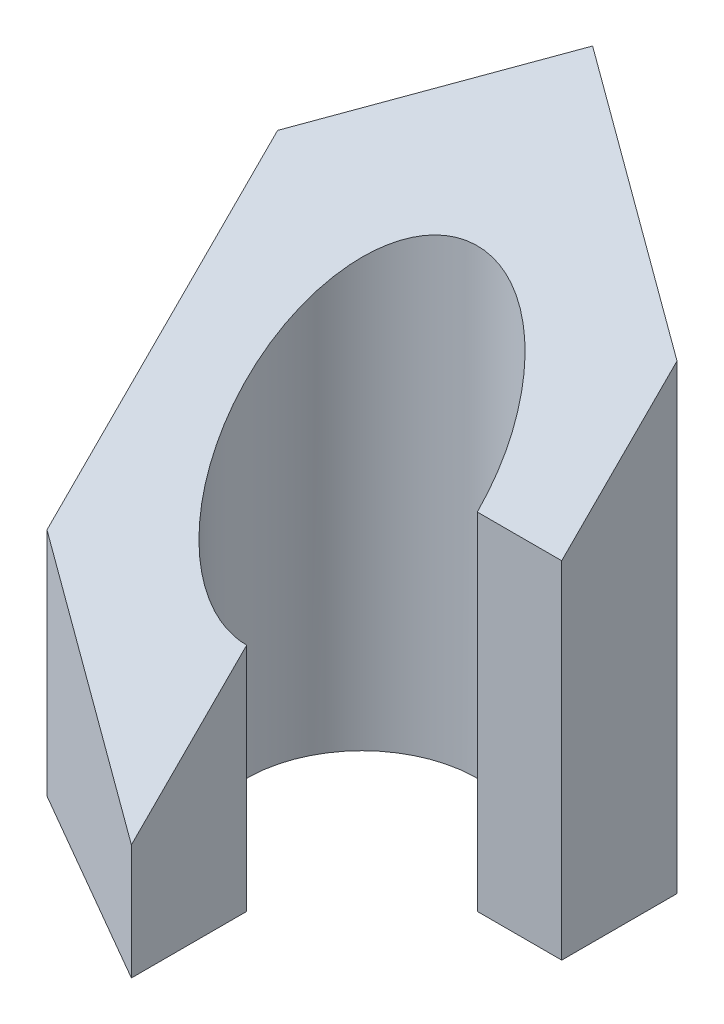
ISO-10303-21;
HEADER;
FILE_DESCRIPTION(('STEP AP214'),'2;1');
FILE_NAME('part.step','',(''),(''),'','','');
FILE_SCHEMA(('AUTOMOTIVE_DESIGN { 1 0 10303 214 1 1 1 1 }'));
ENDSEC;
DATA;
#1=APPLICATION_CONTEXT('core data for automotive mechanical design processes');
#2=APPLICATION_PROTOCOL_DEFINITION('international standard','automotive_design',2000,#1);
#3=PRODUCT_CONTEXT('',#1,'mechanical');
#4=PRODUCT('Part','Part','',(#3));
#5=PRODUCT_RELATED_PRODUCT_CATEGORY('part','',(#4));
#6=PRODUCT_DEFINITION_FORMATION('','',#4);
#7=PRODUCT_DEFINITION_CONTEXT('part definition',#1,'design');
#8=PRODUCT_DEFINITION('design','',#6,#7);
#9=PRODUCT_DEFINITION_SHAPE('','',#8);
#10=(LENGTH_UNIT() NAMED_UNIT(*) SI_UNIT(.MILLI.,.METRE.));
#11=(NAMED_UNIT(*) PLANE_ANGLE_UNIT() SI_UNIT($,.RADIAN.));
#12=(NAMED_UNIT(*) SI_UNIT($,.STERADIAN.) SOLID_ANGLE_UNIT());
#13=UNCERTAINTY_MEASURE_WITH_UNIT(LENGTH_MEASURE(1.E-05),#10,'distance_accuracy_value','');
#14=(GEOMETRIC_REPRESENTATION_CONTEXT(3) GLOBAL_UNCERTAINTY_ASSIGNED_CONTEXT((#13)) GLOBAL_UNIT_ASSIGNED_CONTEXT((#10,
#11,#12)) REPRESENTATION_CONTEXT('',''));
#15=CARTESIAN_POINT('',(0.,0.,0.));
#16=DIRECTION('',(0.,0.,1.));
#17=DIRECTION('',(1.,0.,0.));
#18=AXIS2_PLACEMENT_3D('',#15,#16,#17);
#19=CARTESIAN_POINT('',(3.46410161513776,10.,0.));
#20=DIRECTION('',(-1.,0.,0.));
#21=DIRECTION('',(0.,0.,1.));
#22=AXIS2_PLACEMENT_3D('',#19,#20,#21);
#23=PLANE('',#22);
#24=DIRECTION('',(0.,0.707106781186547,-0.707106781186548));
#25=VECTOR('',#24,1.);
#26=CARTESIAN_POINT('',(3.46410161513776,7.99999999999998,-2.00000000000001));
#27=LINE('',#26,#25);
#28=CARTESIAN_POINT('',(3.46410161513776,5.99999999999997,0.));
#29=VERTEX_POINT('',#28);
#30=CARTESIAN_POINT('',(3.46410161513776,7.99999999999998,-2.));
#31=VERTEX_POINT('',#30);
#32=EDGE_CURVE('E169',#29,#31,#27,.T.);
#33=ORIENTED_EDGE('',*,*,#32,.F.);
#34=DIRECTION('',(0.,-1.,0.));
#35=VECTOR('',#34,1.);
#36=CARTESIAN_POINT('',(3.46410161513776,10.,0.));
#37=LINE('',#36,#35);
#38=CARTESIAN_POINT('',(3.46410161513776,0.,0.));
#39=VERTEX_POINT('',#38);
#40=EDGE_CURVE('E55',#29,#39,#37,.T.);
#41=ORIENTED_EDGE('',*,*,#40,.T.);
#42=DIRECTION('',(0.,0.,-1.));
#43=VECTOR('',#42,1.);
#44=CARTESIAN_POINT('',(3.46410161513776,0.,0.));
#45=LINE('',#44,#43);
#46=CARTESIAN_POINT('',(3.46410161513776,0.,-2.00000000000001));
#47=VERTEX_POINT('',#46);
#48=EDGE_CURVE('E148',#39,#47,#45,.T.);
#49=ORIENTED_EDGE('',*,*,#48,.T.);
#50=DIRECTION('',(0.,-1.,0.));
#51=VECTOR('',#50,1.);
#52=CARTESIAN_POINT('',(3.46410161513776,10.,-2.00000000000001));
#53=LINE('',#52,#51);
#54=EDGE_CURVE('E11',#31,#47,#53,.T.);
#55=ORIENTED_EDGE('',*,*,#54,.F.);
#56=EDGE_LOOP('',(#33,#41,#49,#55));
#57=FACE_BOUND('',#56,.T.);
#58=ADVANCED_FACE('F33',(#57),#23,.F.);
#59=CARTESIAN_POINT('',(3.46410161513776,10.,-2.00000000000001));
#60=DIRECTION('',(-0.499999999999999,0.,0.866025403784439));
#61=DIRECTION('',(0.866025403784439,0.,0.499999999999999));
#62=AXIS2_PLACEMENT_3D('',#59,#60,#61);
#63=PLANE('',#62);
#64=DIRECTION('',(-0.774596669241483,0.447213595499961,-0.447213595499956));
#65=VECTOR('',#64,1.);
#66=CARTESIAN_POINT('',(2.77128129211019,8.39999999999999,-2.40000000000001));
#67=LINE('',#66,#65);
#68=CARTESIAN_POINT('',(0.,10.,-4.));
#69=VERTEX_POINT('',#68);
#70=EDGE_CURVE('E170',#31,#69,#67,.T.);
#71=ORIENTED_EDGE('',*,*,#70,.F.);
#72=ORIENTED_EDGE('',*,*,#54,.T.);
#73=DIRECTION('',(-0.866025403784439,0.,-0.499999999999999));
#74=VECTOR('',#73,1.);
#75=CARTESIAN_POINT('',(3.46410161513776,0.,-2.00000000000001));
#76=LINE('',#75,#74);
#77=CARTESIAN_POINT('',(0.,0.,-4.));
#78=VERTEX_POINT('',#77);
#79=EDGE_CURVE('E143',#47,#78,#76,.T.);
#80=ORIENTED_EDGE('',*,*,#79,.T.);
#81=DIRECTION('',(0.,-1.,0.));
#82=VECTOR('',#81,1.);
#83=CARTESIAN_POINT('',(0.,10.,-4.));
#84=LINE('',#83,#82);
#85=EDGE_CURVE('E40',#69,#78,#84,.T.);
#86=ORIENTED_EDGE('',*,*,#85,.F.);
#87=EDGE_LOOP('',(#71,#72,#80,#86));
#88=FACE_BOUND('',#87,.T.);
#89=ADVANCED_FACE('F177',(#88),#63,.F.);
#90=CARTESIAN_POINT('',(0.,10.,-4.));
#91=DIRECTION('',(0.500000000000001,0.,0.866025403784438));
#92=DIRECTION('',(0.866025403784438,0.,-0.500000000000001));
#93=AXIS2_PLACEMENT_3D('',#90,#91,#92);
#94=PLANE('',#93);
#95=DIRECTION('',(-0.774596669241484,-0.447213595499954,0.44721359549996));
#96=VECTOR('',#95,1.);
#97=CARTESIAN_POINT('',(0.,10.,-4.));
#98=LINE('',#97,#96);
#99=CARTESIAN_POINT('',(-3.46410161513775,8.00000000000002,-2.));
#100=VERTEX_POINT('',#99);
#101=EDGE_CURVE('E136',#69,#100,#98,.T.);
#102=ORIENTED_EDGE('',*,*,#101,.F.);
#103=ORIENTED_EDGE('',*,*,#85,.T.);
#104=DIRECTION('',(-0.866025403784438,0.,0.500000000000001));
#105=VECTOR('',#104,1.);
#106=CARTESIAN_POINT('',(0.,0.,-4.));
#107=LINE('',#106,#105);
#108=CARTESIAN_POINT('',(-3.46410161513775,0.,-2.));
#109=VERTEX_POINT('',#108);
#110=EDGE_CURVE('E134',#78,#109,#107,.T.);
#111=ORIENTED_EDGE('',*,*,#110,.T.);
#112=DIRECTION('',(0.,-1.,0.));
#113=VECTOR('',#112,1.);
#114=CARTESIAN_POINT('',(-3.46410161513775,10.,-2.));
#115=LINE('',#114,#113);
#116=EDGE_CURVE('E120',#100,#109,#115,.T.);
#117=ORIENTED_EDGE('',*,*,#116,.F.);
#118=EDGE_LOOP('',(#102,#103,#111,#117));
#119=FACE_BOUND('',#118,.T.);
#120=ADVANCED_FACE('F132',(#119),#94,.F.);
#121=CARTESIAN_POINT('',(-3.46410161513775,10.,-2.));
#122=DIRECTION('',(1.,0.,0.));
#123=DIRECTION('',(0.,0.,-1.));
#124=AXIS2_PLACEMENT_3D('',#121,#122,#123);
#125=PLANE('',#124);
#126=DIRECTION('',(0.,-0.707106781186547,0.707106781186548));
#127=VECTOR('',#126,1.);
#128=CARTESIAN_POINT('',(-3.46410161513775,9.00000000000001,-2.99999999999999));
#129=LINE('',#128,#127);
#130=CARTESIAN_POINT('',(-3.46410161513775,4.00000000000003,2.));
#131=VERTEX_POINT('',#130);
#132=EDGE_CURVE('E101',#100,#131,#129,.T.);
#133=ORIENTED_EDGE('',*,*,#132,.F.);
#134=ORIENTED_EDGE('',*,*,#116,.T.);
#135=DIRECTION('',(0.,0.,1.));
#136=VECTOR('',#135,1.);
#137=CARTESIAN_POINT('',(-3.46410161513775,0.,-2.));
#138=LINE('',#137,#136);
#139=CARTESIAN_POINT('',(-3.46410161513775,0.,2.));
#140=VERTEX_POINT('',#139);
#141=EDGE_CURVE('E145',#109,#140,#138,.T.);
#142=ORIENTED_EDGE('',*,*,#141,.T.);
#143=DIRECTION('',(0.,-1.,0.));
#144=VECTOR('',#143,1.);
#145=CARTESIAN_POINT('',(-3.46410161513775,10.,2.));
#146=LINE('',#145,#144);
#147=EDGE_CURVE('E118',#131,#140,#146,.T.);
#148=ORIENTED_EDGE('',*,*,#147,.F.);
#149=EDGE_LOOP('',(#133,#134,#142,#148));
#150=FACE_BOUND('',#149,.T.);
#151=ADVANCED_FACE('F179',(#150),#125,.F.);
#152=CARTESIAN_POINT('',(-3.46410161513775,10.,2.));
#153=DIRECTION('',(0.5,0.,-0.866025403784439));
#154=DIRECTION('',(-0.866025403784439,0.,-0.5));
#155=AXIS2_PLACEMENT_3D('',#152,#153,#154);
#156=PLANE('',#155);
#157=DIRECTION('',(0.774596669241482,-0.447213595499962,0.447213595499957));
#158=VECTOR('',#157,1.);
#159=CARTESIAN_POINT('',(-5.54256258422041,5.20000000000004,0.799999999999997));
#160=LINE('',#159,#158);
#161=CARTESIAN_POINT('',(0.,2.,4.));
#162=VERTEX_POINT('',#161);
#163=EDGE_CURVE('E96',#131,#162,#160,.T.);
#164=ORIENTED_EDGE('',*,*,#163,.F.);
#165=ORIENTED_EDGE('',*,*,#147,.T.);
#166=DIRECTION('',(0.866025403784439,0.,0.5));
#167=VECTOR('',#166,1.);
#168=CARTESIAN_POINT('',(-3.46410161513775,0.,2.));
#169=LINE('',#168,#167);
#170=CARTESIAN_POINT('',(0.,0.,4.));
#171=VERTEX_POINT('',#170);
#172=EDGE_CURVE('E116',#140,#171,#169,.T.);
#173=ORIENTED_EDGE('',*,*,#172,.T.);
#174=DIRECTION('',(0.,-1.,0.));
#175=VECTOR('',#174,1.);
#176=CARTESIAN_POINT('',(0.,10.,4.));
#177=LINE('',#176,#175);
#178=EDGE_CURVE('E110',#162,#171,#177,.T.);
#179=ORIENTED_EDGE('',*,*,#178,.F.);
#180=EDGE_LOOP('',(#164,#165,#173,#179));
#181=FACE_BOUND('',#180,.T.);
#182=ADVANCED_FACE('F114',(#181),#156,.F.);
#183=CARTESIAN_POINT('',(0.,10.,2.));
#184=DIRECTION('',(-1.,0.,0.));
#185=DIRECTION('',(0.,0.,1.));
#186=AXIS2_PLACEMENT_3D('',#183,#184,#185);
#187=PLANE('',#186);
#188=DIRECTION('',(0.,0.707106781186547,-0.707106781186548));
#189=VECTOR('',#188,1.);
#190=CARTESIAN_POINT('',(0.,7.,-0.999999999999999));
#191=LINE('',#190,#189);
#192=CARTESIAN_POINT('',(0.,4.,2.));
#193=VERTEX_POINT('',#192);
#194=EDGE_CURVE('E99',#162,#193,#191,.T.);
#195=ORIENTED_EDGE('',*,*,#194,.F.);
#196=ORIENTED_EDGE('',*,*,#178,.T.);
#197=DIRECTION('',(0.,0.,-1.));
#198=VECTOR('',#197,1.);
#199=CARTESIAN_POINT('',(0.,0.,2.));
#200=LINE('',#199,#198);
#201=CARTESIAN_POINT('',(0.,0.,2.));
#202=VERTEX_POINT('',#201);
#203=EDGE_CURVE('E153',#171,#202,#200,.T.);
#204=ORIENTED_EDGE('',*,*,#203,.T.);
#205=DIRECTION('',(0.,-1.,0.));
#206=VECTOR('',#205,1.);
#207=CARTESIAN_POINT('',(0.,10.,2.));
#208=LINE('',#207,#206);
#209=EDGE_CURVE('E112',#193,#202,#208,.T.);
#210=ORIENTED_EDGE('',*,*,#209,.F.);
#211=EDGE_LOOP('',(#195,#196,#204,#210));
#212=FACE_BOUND('',#211,.T.);
#213=ADVANCED_FACE('F108',(#212),#187,.F.);
#214=CARTESIAN_POINT('',(0.,10.,0.));
#215=DIRECTION('',(0.,-1.,0.));
#216=DIRECTION('',(0.,0.,-1.));
#217=AXIS2_PLACEMENT_3D('',#214,#215,#216);
#218=CYLINDRICAL_SURFACE('',#217,2.);
#219=CARTESIAN_POINT('',(0.,6.,0.));
#220=DIRECTION('',(0.,0.707106781186548,0.707106781186547));
#221=DIRECTION('',(0.,-0.707106781186547,0.707106781186548));
#222=AXIS2_PLACEMENT_3D('',#219,#220,#221);
#223=ELLIPSE('',#222,2.82842712474619,2.);
#224=CARTESIAN_POINT('',(2.,5.99999999999998,0.));
#225=VERTEX_POINT('',#224);
#226=EDGE_CURVE('E47',#193,#225,#223,.F.);
#227=ORIENTED_EDGE('',*,*,#226,.F.);
#228=ORIENTED_EDGE('',*,*,#209,.T.);
#229=CARTESIAN_POINT('',(0.,0.,0.));
#230=DIRECTION('',(0.,-1.,0.));
#231=DIRECTION('',(0.,0.,1.));
#232=AXIS2_PLACEMENT_3D('',#229,#230,#231);
#233=CIRCLE('',#232,2.);
#234=CARTESIAN_POINT('',(2.,0.,0.));
#235=VERTEX_POINT('',#234);
#236=EDGE_CURVE('E155',#202,#235,#233,.T.);
#237=ORIENTED_EDGE('',*,*,#236,.T.);
#238=DIRECTION('',(0.,-1.,0.));
#239=VECTOR('',#238,1.);
#240=CARTESIAN_POINT('',(2.,10.,0.));
#241=LINE('',#240,#239);
#242=EDGE_CURVE('E122',#225,#235,#241,.T.);
#243=ORIENTED_EDGE('',*,*,#242,.F.);
#244=EDGE_LOOP('',(#227,#228,#237,#243));
#245=FACE_BOUND('',#244,.T.);
#246=ADVANCED_FACE('F167',(#245),#218,.F.);
#247=CARTESIAN_POINT('',(2.,10.,0.));
#248=DIRECTION('',(0.,0.,-1.));
#249=DIRECTION('',(-1.,0.,0.));
#250=AXIS2_PLACEMENT_3D('',#247,#248,#249);
#251=PLANE('',#250);
#252=DIRECTION('',(1.,0.,0.));
#253=VECTOR('',#252,1.);
#254=CARTESIAN_POINT('',(1.99999999999996,5.99999999999999,0.));
#255=LINE('',#254,#253);
#256=EDGE_CURVE('E164',#225,#29,#255,.T.);
#257=ORIENTED_EDGE('',*,*,#256,.F.);
#258=ORIENTED_EDGE('',*,*,#242,.T.);
#259=DIRECTION('',(1.,0.,0.));
#260=VECTOR('',#259,1.);
#261=CARTESIAN_POINT('',(2.,0.,0.));
#262=LINE('',#261,#260);
#263=EDGE_CURVE('E158',#235,#39,#262,.T.);
#264=ORIENTED_EDGE('',*,*,#263,.T.);
#265=ORIENTED_EDGE('',*,*,#40,.F.);
#266=EDGE_LOOP('',(#257,#258,#264,#265));
#267=FACE_BOUND('',#266,.T.);
#268=ADVANCED_FACE('F162',(#267),#251,.F.);
#269=CARTESIAN_POINT('',(0.,0.,0.));
#270=DIRECTION('',(0.,1.,0.));
#271=DIRECTION('',(0.,0.,1.));
#272=AXIS2_PLACEMENT_3D('',#269,#270,#271);
#273=PLANE('',#272);
#274=ORIENTED_EDGE('',*,*,#48,.F.);
#275=ORIENTED_EDGE('',*,*,#263,.F.);
#276=ORIENTED_EDGE('',*,*,#236,.F.);
#277=ORIENTED_EDGE('',*,*,#203,.F.);
#278=ORIENTED_EDGE('',*,*,#172,.F.);
#279=ORIENTED_EDGE('',*,*,#141,.F.);
#280=ORIENTED_EDGE('',*,*,#110,.F.);
#281=ORIENTED_EDGE('',*,*,#79,.F.);
#282=EDGE_LOOP('',(#274,#275,#276,#277,#278,#279,#280,#281));
#283=FACE_BOUND('',#282,.T.);
#284=ADVANCED_FACE('F142',(#283),#273,.F.);
#285=CARTESIAN_POINT('',(10.,2.,3.99999999999993));
#286=DIRECTION('',(0.,0.707106781186548,0.707106781186547));
#287=DIRECTION('',(0.,-0.707106781186547,0.707106781186548));
#288=AXIS2_PLACEMENT_3D('',#285,#286,#287);
#289=PLANE('',#288);
#290=ORIENTED_EDGE('',*,*,#32,.T.);
#291=ORIENTED_EDGE('',*,*,#70,.T.);
#292=ORIENTED_EDGE('',*,*,#101,.T.);
#293=ORIENTED_EDGE('',*,*,#132,.T.);
#294=ORIENTED_EDGE('',*,*,#163,.T.);
#295=ORIENTED_EDGE('',*,*,#194,.T.);
#296=ORIENTED_EDGE('',*,*,#226,.T.);
#297=ORIENTED_EDGE('',*,*,#256,.T.);
#298=EDGE_LOOP('',(#290,#291,#292,#293,#294,#295,#296,#297));
#299=FACE_BOUND('',#298,.T.);
#300=ADVANCED_FACE('F98',(#299),#289,.T.);
#301=CLOSED_SHELL('',(#58,#89,#120,#151,#182,#213,#246,#268,#284,#300));
#302=MANIFOLD_SOLID_BREP('B2',#301);
#303=ADVANCED_BREP_SHAPE_REPRESENTATION('',(#18,#302),#14);
#304=SHAPE_DEFINITION_REPRESENTATION(#9,#303);
ENDSEC;
END-ISO-10303-21;
